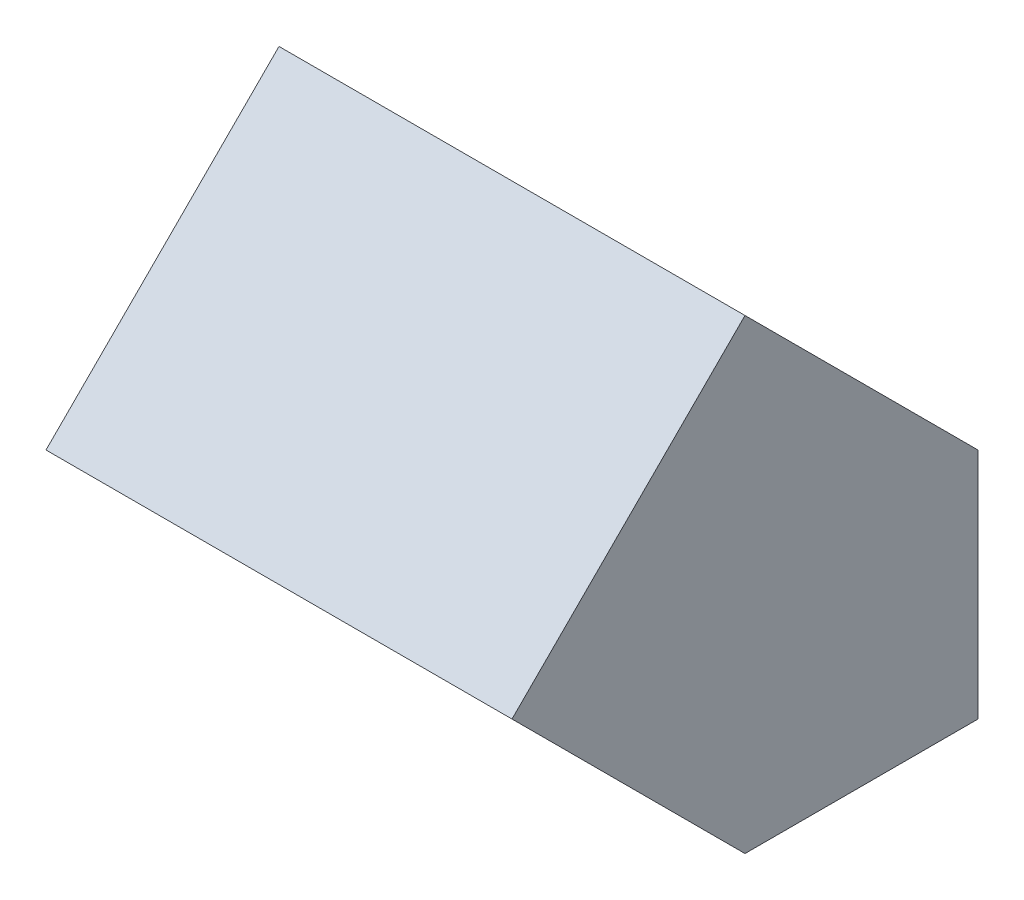
ISO-10303-21;
HEADER;
FILE_DESCRIPTION(('STEP AP214'),'2;1');
FILE_NAME('part.step','',(''),(''),'','','');
FILE_SCHEMA(('AUTOMOTIVE_DESIGN { 1 0 10303 214 1 1 1 1 }'));
ENDSEC;
DATA;
#1=APPLICATION_CONTEXT('core data for automotive mechanical design processes');
#2=APPLICATION_PROTOCOL_DEFINITION('international standard','automotive_design',2000,#1);
#3=PRODUCT_CONTEXT('',#1,'mechanical');
#4=PRODUCT('Part','Part','',(#3));
#5=PRODUCT_RELATED_PRODUCT_CATEGORY('part','',(#4));
#6=PRODUCT_DEFINITION_FORMATION('','',#4);
#7=PRODUCT_DEFINITION_CONTEXT('part definition',#1,'design');
#8=PRODUCT_DEFINITION('design','',#6,#7);
#9=PRODUCT_DEFINITION_SHAPE('','',#8);
#10=(LENGTH_UNIT() NAMED_UNIT(*) SI_UNIT(.MILLI.,.METRE.));
#11=(NAMED_UNIT(*) PLANE_ANGLE_UNIT() SI_UNIT($,.RADIAN.));
#12=(NAMED_UNIT(*) SI_UNIT($,.STERADIAN.) SOLID_ANGLE_UNIT());
#13=UNCERTAINTY_MEASURE_WITH_UNIT(LENGTH_MEASURE(1.E-05),#10,'distance_accuracy_value','');
#14=(GEOMETRIC_REPRESENTATION_CONTEXT(3) GLOBAL_UNCERTAINTY_ASSIGNED_CONTEXT((#13)) GLOBAL_UNIT_ASSIGNED_CONTEXT((#10,
#11,#12)) REPRESENTATION_CONTEXT('',''));
#15=CARTESIAN_POINT('',(0.,0.,0.));
#16=DIRECTION('',(0.,0.,1.));
#17=DIRECTION('',(1.,0.,0.));
#18=AXIS2_PLACEMENT_3D('',#15,#16,#17);
#19=CARTESIAN_POINT('',(0.,0.,40.));
#20=DIRECTION('',(1.,0.,0.));
#21=DIRECTION('',(0.,0.,-1.));
#22=AXIS2_PLACEMENT_3D('',#19,#20,#21);
#23=PLANE('',#22);
#24=DIRECTION('',(0.,-0.707106781186548,-0.707106781186547));
#25=VECTOR('',#24,1.);
#26=CARTESIAN_POINT('',(0.,40.,20.));
#27=LINE('',#26,#25);
#28=CARTESIAN_POINT('',(0.,40.,20.));
#29=VERTEX_POINT('',#28);
#30=CARTESIAN_POINT('',(0.,20.,0.));
#31=VERTEX_POINT('',#30);
#32=EDGE_CURVE('E103',#29,#31,#27,.T.);
#33=ORIENTED_EDGE('',*,*,#32,.T.);
#34=DIRECTION('',(0.,-1.,0.));
#35=VECTOR('',#34,1.);
#36=CARTESIAN_POINT('',(0.,0.,0.));
#37=LINE('',#36,#35);
#38=CARTESIAN_POINT('',(0.,0.,0.));
#39=VERTEX_POINT('',#38);
#40=EDGE_CURVE('E72',#31,#39,#37,.T.);
#41=ORIENTED_EDGE('',*,*,#40,.T.);
#42=DIRECTION('',(0.,0.,-1.));
#43=VECTOR('',#42,1.);
#44=CARTESIAN_POINT('',(0.,0.,40.));
#45=LINE('',#44,#43);
#46=CARTESIAN_POINT('',(0.,0.,20.));
#47=VERTEX_POINT('',#46);
#48=EDGE_CURVE('E12',#47,#39,#45,.T.);
#49=ORIENTED_EDGE('',*,*,#48,.F.);
#50=DIRECTION('',(0.,0.707106781186548,0.707106781186548));
#51=VECTOR('',#50,1.);
#52=CARTESIAN_POINT('',(0.,-10.,10.));
#53=LINE('',#52,#51);
#54=CARTESIAN_POINT('',(0.,20.,40.));
#55=VERTEX_POINT('',#54);
#56=EDGE_CURVE('E136',#47,#55,#53,.T.);
#57=ORIENTED_EDGE('',*,*,#56,.T.);
#58=DIRECTION('',(0.,0.707106781186548,-0.707106781186548));
#59=VECTOR('',#58,1.);
#60=CARTESIAN_POINT('',(0.,30.,30.));
#61=LINE('',#60,#59);
#62=EDGE_CURVE('E119',#55,#29,#61,.T.);
#63=ORIENTED_EDGE('',*,*,#62,.T.);
#64=EDGE_LOOP('',(#33,#41,#49,#57,#63));
#65=FACE_BOUND('',#64,.T.);
#66=ADVANCED_FACE('F51',(#65),#23,.F.);
#67=CARTESIAN_POINT('',(40.,0.,40.));
#68=DIRECTION('',(-1.,0.,0.));
#69=DIRECTION('',(0.,0.,1.));
#70=AXIS2_PLACEMENT_3D('',#67,#68,#69);
#71=PLANE('',#70);
#72=DIRECTION('',(0.,-0.707106781186548,-0.707106781186547));
#73=VECTOR('',#72,1.);
#74=CARTESIAN_POINT('',(40.,40.,20.));
#75=LINE('',#74,#73);
#76=CARTESIAN_POINT('',(40.,40.,20.));
#77=VERTEX_POINT('',#76);
#78=CARTESIAN_POINT('',(40.,20.,0.));
#79=VERTEX_POINT('',#78);
#80=EDGE_CURVE('E101',#77,#79,#75,.T.);
#81=ORIENTED_EDGE('',*,*,#80,.F.);
#82=DIRECTION('',(0.,0.707106781186548,-0.707106781186548));
#83=VECTOR('',#82,1.);
#84=CARTESIAN_POINT('',(40.,30.,30.));
#85=LINE('',#84,#83);
#86=CARTESIAN_POINT('',(40.,20.,40.));
#87=VERTEX_POINT('',#86);
#88=EDGE_CURVE('E112',#87,#77,#85,.T.);
#89=ORIENTED_EDGE('',*,*,#88,.F.);
#90=DIRECTION('',(0.,0.707106781186548,0.707106781186548));
#91=VECTOR('',#90,1.);
#92=CARTESIAN_POINT('',(40.,-10.,10.));
#93=LINE('',#92,#91);
#94=CARTESIAN_POINT('',(40.,0.,20.));
#95=VERTEX_POINT('',#94);
#96=EDGE_CURVE('E122',#95,#87,#93,.T.);
#97=ORIENTED_EDGE('',*,*,#96,.F.);
#98=DIRECTION('',(0.,0.,-1.));
#99=VECTOR('',#98,1.);
#100=CARTESIAN_POINT('',(40.,0.,40.));
#101=LINE('',#100,#99);
#102=CARTESIAN_POINT('',(40.,0.,0.));
#103=VERTEX_POINT('',#102);
#104=EDGE_CURVE('E58',#95,#103,#101,.T.);
#105=ORIENTED_EDGE('',*,*,#104,.T.);
#106=DIRECTION('',(0.,1.,0.));
#107=VECTOR('',#106,1.);
#108=CARTESIAN_POINT('',(40.,0.,0.));
#109=LINE('',#108,#107);
#110=EDGE_CURVE('E114',#103,#79,#109,.T.);
#111=ORIENTED_EDGE('',*,*,#110,.T.);
#112=EDGE_LOOP('',(#81,#89,#97,#105,#111));
#113=FACE_BOUND('',#112,.T.);
#114=ADVANCED_FACE('F111',(#113),#71,.F.);
#115=CARTESIAN_POINT('',(0.,0.,0.));
#116=DIRECTION('',(0.,0.,-1.));
#117=DIRECTION('',(-1.,0.,0.));
#118=AXIS2_PLACEMENT_3D('',#115,#116,#117);
#119=PLANE('',#118);
#120=ORIENTED_EDGE('',*,*,#40,.F.);
#121=DIRECTION('',(-1.,0.,0.));
#122=VECTOR('',#121,1.);
#123=CARTESIAN_POINT('',(40.,20.,0.));
#124=LINE('',#123,#122);
#125=EDGE_CURVE('E115',#79,#31,#124,.T.);
#126=ORIENTED_EDGE('',*,*,#125,.F.);
#127=ORIENTED_EDGE('',*,*,#110,.F.);
#128=DIRECTION('',(1.,0.,0.));
#129=VECTOR('',#128,1.);
#130=CARTESIAN_POINT('',(0.,0.,0.));
#131=LINE('',#130,#129);
#132=EDGE_CURVE('E128',#39,#103,#131,.T.);
#133=ORIENTED_EDGE('',*,*,#132,.F.);
#134=EDGE_LOOP('',(#120,#126,#127,#133));
#135=FACE_BOUND('',#134,.T.);
#136=ADVANCED_FACE('F135',(#135),#119,.T.);
#137=CARTESIAN_POINT('',(0.,0.,40.));
#138=DIRECTION('',(0.,1.,0.));
#139=DIRECTION('',(0.,0.,1.));
#140=AXIS2_PLACEMENT_3D('',#137,#138,#139);
#141=PLANE('',#140);
#142=DIRECTION('',(-1.,0.,0.));
#143=VECTOR('',#142,1.);
#144=CARTESIAN_POINT('',(40.,0.,20.));
#145=LINE('',#144,#143);
#146=EDGE_CURVE('E139',#95,#47,#145,.T.);
#147=ORIENTED_EDGE('',*,*,#146,.T.);
#148=ORIENTED_EDGE('',*,*,#48,.T.);
#149=ORIENTED_EDGE('',*,*,#132,.T.);
#150=ORIENTED_EDGE('',*,*,#104,.F.);
#151=EDGE_LOOP('',(#147,#148,#149,#150));
#152=FACE_BOUND('',#151,.T.);
#153=ADVANCED_FACE('F133',(#152),#141,.F.);
#154=CARTESIAN_POINT('',(40.,30.,30.));
#155=DIRECTION('',(0.,0.707106781186548,0.707106781186548));
#156=DIRECTION('',(0.,-0.707106781186548,0.707106781186548));
#157=AXIS2_PLACEMENT_3D('',#154,#155,#156);
#158=PLANE('',#157);
#159=ORIENTED_EDGE('',*,*,#62,.F.);
#160=DIRECTION('',(-1.,0.,0.));
#161=VECTOR('',#160,1.);
#162=CARTESIAN_POINT('',(40.,20.,40.));
#163=LINE('',#162,#161);
#164=EDGE_CURVE('E108',#87,#55,#163,.T.);
#165=ORIENTED_EDGE('',*,*,#164,.F.);
#166=ORIENTED_EDGE('',*,*,#88,.T.);
#167=DIRECTION('',(-1.,0.,0.));
#168=VECTOR('',#167,1.);
#169=CARTESIAN_POINT('',(40.,40.,20.));
#170=LINE('',#169,#168);
#171=EDGE_CURVE('E98',#77,#29,#170,.T.);
#172=ORIENTED_EDGE('',*,*,#171,.T.);
#173=EDGE_LOOP('',(#159,#165,#166,#172));
#174=FACE_BOUND('',#173,.T.);
#175=ADVANCED_FACE('F118',(#174),#158,.T.);
#176=CARTESIAN_POINT('',(40.,-10.,10.));
#177=DIRECTION('',(0.,-0.707106781186548,0.707106781186548));
#178=DIRECTION('',(0.,-0.707106781186548,-0.707106781186548));
#179=AXIS2_PLACEMENT_3D('',#176,#177,#178);
#180=PLANE('',#179);
#181=ORIENTED_EDGE('',*,*,#56,.F.);
#182=ORIENTED_EDGE('',*,*,#146,.F.);
#183=ORIENTED_EDGE('',*,*,#96,.T.);
#184=ORIENTED_EDGE('',*,*,#164,.T.);
#185=EDGE_LOOP('',(#181,#182,#183,#184));
#186=FACE_BOUND('',#185,.T.);
#187=ADVANCED_FACE('F143',(#186),#180,.T.);
#188=CARTESIAN_POINT('',(40.,40.,20.));
#189=DIRECTION('',(0.,0.707106781186547,-0.707106781186548));
#190=DIRECTION('',(0.,0.707106781186548,0.707106781186547));
#191=AXIS2_PLACEMENT_3D('',#188,#189,#190);
#192=PLANE('',#191);
#193=ORIENTED_EDGE('',*,*,#32,.F.);
#194=ORIENTED_EDGE('',*,*,#171,.F.);
#195=ORIENTED_EDGE('',*,*,#80,.T.);
#196=ORIENTED_EDGE('',*,*,#125,.T.);
#197=EDGE_LOOP('',(#193,#194,#195,#196));
#198=FACE_BOUND('',#197,.T.);
#199=ADVANCED_FACE('F100',(#198),#192,.T.);
#200=CLOSED_SHELL('',(#66,#114,#136,#153,#175,#187,#199));
#201=MANIFOLD_SOLID_BREP('B2',#200);
#202=ADVANCED_BREP_SHAPE_REPRESENTATION('',(#18,#201),#14);
#203=SHAPE_DEFINITION_REPRESENTATION(#9,#202);
ENDSEC;
END-ISO-10303-21;
